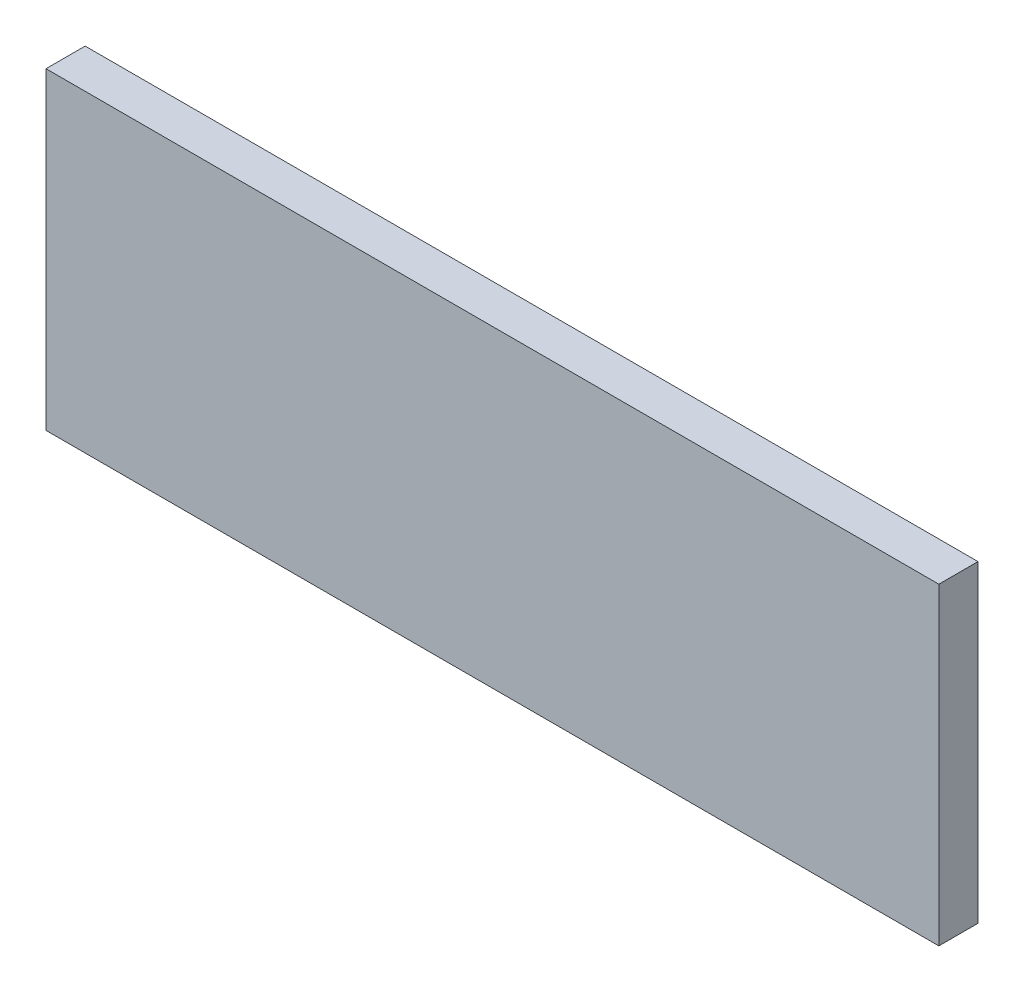
ISO-10303-21;
HEADER;
FILE_DESCRIPTION(('STEP AP214'),'2;1');
FILE_NAME('part.step','',(''),(''),'','','');
FILE_SCHEMA(('AUTOMOTIVE_DESIGN { 1 0 10303 214 1 1 1 1 }'));
ENDSEC;
DATA;
#1=APPLICATION_CONTEXT('core data for automotive mechanical design processes');
#2=APPLICATION_PROTOCOL_DEFINITION('international standard','automotive_design',2000,#1);
#3=PRODUCT_CONTEXT('',#1,'mechanical');
#4=PRODUCT('Part','Part','',(#3));
#5=PRODUCT_RELATED_PRODUCT_CATEGORY('part','',(#4));
#6=PRODUCT_DEFINITION_FORMATION('','',#4);
#7=PRODUCT_DEFINITION_CONTEXT('part definition',#1,'design');
#8=PRODUCT_DEFINITION('design','',#6,#7);
#9=PRODUCT_DEFINITION_SHAPE('','',#8);
#10=(LENGTH_UNIT() NAMED_UNIT(*) SI_UNIT(.MILLI.,.METRE.));
#11=(NAMED_UNIT(*) PLANE_ANGLE_UNIT() SI_UNIT($,.RADIAN.));
#12=(NAMED_UNIT(*) SI_UNIT($,.STERADIAN.) SOLID_ANGLE_UNIT());
#13=UNCERTAINTY_MEASURE_WITH_UNIT(LENGTH_MEASURE(1.E-05),#10,'distance_accuracy_value','');
#14=(GEOMETRIC_REPRESENTATION_CONTEXT(3) GLOBAL_UNCERTAINTY_ASSIGNED_CONTEXT((#13)) GLOBAL_UNIT_ASSIGNED_CONTEXT((#10,
#11,#12)) REPRESENTATION_CONTEXT('',''));
#15=CARTESIAN_POINT('',(0.,0.,0.));
#16=DIRECTION('',(0.,0.,1.));
#17=DIRECTION('',(1.,0.,0.));
#18=AXIS2_PLACEMENT_3D('',#15,#16,#17);
#19=CARTESIAN_POINT('',(-12.2499999999998,-23.,-11.2500000000002));
#20=DIRECTION('',(0.,0.,-1.));
#21=DIRECTION('',(-1.,0.,0.));
#22=AXIS2_PLACEMENT_3D('',#19,#20,#21);
#23=PLANE('',#22);
#24=DIRECTION('',(1.,0.,0.));
#25=VECTOR('',#24,1.);
#26=CARTESIAN_POINT('',(74.9989953281253,-93.7000005401676,-11.2500000000006));
#27=LINE('',#26,#25);
#28=CARTESIAN_POINT('',(-14.2499999999989,-93.7000005401676,-11.2500000000005));
#29=VERTEX_POINT('',#28);
#30=CARTESIAN_POINT('',(14.25,-93.7000005401676,-11.2500000000003));
#31=VERTEX_POINT('',#30);
#32=EDGE_CURVE('E20',#29,#31,#27,.T.);
#33=ORIENTED_EDGE('',*,*,#32,.F.);
#34=DIRECTION('',(0.,1.,0.));
#35=VECTOR('',#34,1.);
#36=CARTESIAN_POINT('',(-14.2499999999989,-33.4535583778433,-11.2500000000006));
#37=LINE('',#36,#35);
#38=CARTESIAN_POINT('',(-14.2499999999989,-83.7000005401676,-11.2500000000004));
#39=VERTEX_POINT('',#38);
#40=EDGE_CURVE('E79',#39,#29,#37,.F.);
#41=ORIENTED_EDGE('',*,*,#40,.F.);
#42=DIRECTION('',(1.,0.,0.));
#43=VECTOR('',#42,1.);
#44=CARTESIAN_POINT('',(74.9989953760509,-83.7000005401676,-11.2500000000003));
#45=LINE('',#44,#43);
#46=CARTESIAN_POINT('',(14.25,-83.7000005401676,-11.2500000000003));
#47=VERTEX_POINT('',#46);
#48=EDGE_CURVE('E61',#47,#39,#45,.F.);
#49=ORIENTED_EDGE('',*,*,#48,.F.);
#50=DIRECTION('',(0.,1.,0.));
#51=VECTOR('',#50,1.);
#52=CARTESIAN_POINT('',(14.25,-33.4535583778433,-11.2500000000003));
#53=LINE('',#52,#51);
#54=EDGE_CURVE('E56',#31,#47,#53,.T.);
#55=ORIENTED_EDGE('',*,*,#54,.F.);
#56=EDGE_LOOP('',(#33,#41,#49,#55));
#57=FACE_BOUND('',#56,.T.);
#58=ADVANCED_FACE('F17',(#57),#23,.T.);
#59=CARTESIAN_POINT('',(74.9989953281253,-93.7000005401676,-19.9999996196601));
#60=DIRECTION('',(0.,-1.,0.));
#61=DIRECTION('',(0.,0.,-1.));
#62=AXIS2_PLACEMENT_3D('',#59,#60,#61);
#63=PLANE('',#62);
#64=DIRECTION('',(1.,0.,-4.79255768693432E-09));
#65=VECTOR('',#64,1.);
#66=CARTESIAN_POINT('',(74.9989953760522,-93.7000005401776,-9.99999961966009));
#67=LINE('',#66,#65);
#68=CARTESIAN_POINT('',(-14.2499999999989,-93.7000005401701,-9.99999926020327));
#69=VERTEX_POINT('',#68);
#70=CARTESIAN_POINT('',(14.25,-93.7000005401701,-9.99999932850684));
#71=VERTEX_POINT('',#70);
#72=EDGE_CURVE('E83',#69,#71,#67,.T.);
#73=ORIENTED_EDGE('',*,*,#72,.F.);
#74=DIRECTION('',(0.,0.,1.));
#75=VECTOR('',#74,1.);
#76=CARTESIAN_POINT('',(-14.2499999999995,-93.7000005401676,11.9999999999998));
#77=LINE('',#76,#75);
#78=EDGE_CURVE('E68',#29,#69,#77,.T.);
#79=ORIENTED_EDGE('',*,*,#78,.F.);
#80=ORIENTED_EDGE('',*,*,#32,.T.);
#81=DIRECTION('',(0.,0.,1.));
#82=VECTOR('',#81,1.);
#83=CARTESIAN_POINT('',(14.25,-93.7000005401676,12.));
#84=LINE('',#83,#82);
#85=EDGE_CURVE('E63',#71,#31,#84,.F.);
#86=ORIENTED_EDGE('',*,*,#85,.F.);
#87=EDGE_LOOP('',(#73,#79,#80,#86));
#88=FACE_BOUND('',#87,.T.);
#89=ADVANCED_FACE('F65',(#88),#63,.T.);
#90=CARTESIAN_POINT('',(14.25,-33.4535583778433,12.));
#91=DIRECTION('',(1.,0.,0.));
#92=DIRECTION('',(0.,1.,0.));
#93=AXIS2_PLACEMENT_3D('',#90,#91,#92);
#94=PLANE('',#93);
#95=DIRECTION('',(0.,1.,0.));
#96=VECTOR('',#95,1.);
#97=CARTESIAN_POINT('',(14.25,-93.7000005401676,-9.99999932851703));
#98=LINE('',#97,#96);
#99=CARTESIAN_POINT('',(14.25,-83.7000005401701,-9.99999929434968));
#100=VERTEX_POINT('',#99);
#101=EDGE_CURVE('E72',#71,#100,#98,.T.);
#102=ORIENTED_EDGE('',*,*,#101,.F.);
#103=ORIENTED_EDGE('',*,*,#85,.T.);
#104=ORIENTED_EDGE('',*,*,#54,.T.);
#105=DIRECTION('',(0.,0.,1.));
#106=VECTOR('',#105,1.);
#107=CARTESIAN_POINT('',(14.25,-83.7000005401676,-9.99999961966009));
#108=LINE('',#107,#106);
#109=EDGE_CURVE('E74',#100,#47,#108,.F.);
#110=ORIENTED_EDGE('',*,*,#109,.F.);
#111=EDGE_LOOP('',(#102,#103,#104,#110));
#112=FACE_BOUND('',#111,.T.);
#113=ADVANCED_FACE('F70',(#112),#94,.T.);
#114=CARTESIAN_POINT('',(74.9989953760509,-83.7000005401676,-9.99999961966009));
#115=DIRECTION('',(0.,1.,0.));
#116=DIRECTION('',(0.,0.,1.));
#117=AXIS2_PLACEMENT_3D('',#114,#115,#116);
#118=PLANE('',#117);
#119=ORIENTED_EDGE('',*,*,#48,.T.);
#120=DIRECTION('',(0.,0.,1.));
#121=VECTOR('',#120,1.);
#122=CARTESIAN_POINT('',(-14.2499999999995,-83.7000005401676,11.9999999999998));
#123=LINE('',#122,#121);
#124=CARTESIAN_POINT('',(-14.2499999999989,-83.7000005401701,-9.99999919190932));
#125=VERTEX_POINT('',#124);
#126=EDGE_CURVE('E35',#125,#39,#123,.F.);
#127=ORIENTED_EDGE('',*,*,#126,.F.);
#128=DIRECTION('',(1.,0.,-4.79255768693432E-09));
#129=VECTOR('',#128,1.);
#130=CARTESIAN_POINT('',(74.9989953760522,-83.7000005401776,-9.99999961966009));
#131=LINE('',#130,#129);
#132=EDGE_CURVE('E26',#100,#125,#131,.F.);
#133=ORIENTED_EDGE('',*,*,#132,.F.);
#134=ORIENTED_EDGE('',*,*,#109,.T.);
#135=EDGE_LOOP('',(#119,#127,#133,#134));
#136=FACE_BOUND('',#135,.T.);
#137=ADVANCED_FACE('F89',(#136),#118,.T.);
#138=CARTESIAN_POINT('',(-14.2499999999995,-33.4535583778433,11.9999999999998));
#139=DIRECTION('',(-1.,0.,0.));
#140=DIRECTION('',(0.,0.,1.));
#141=AXIS2_PLACEMENT_3D('',#138,#139,#140);
#142=PLANE('',#141);
#143=DIRECTION('',(0.,1.,0.));
#144=VECTOR('',#143,1.);
#145=CARTESIAN_POINT('',(-14.2499999999989,-93.7000005401676,-9.99999919192913));
#146=LINE('',#145,#144);
#147=EDGE_CURVE('E11',#125,#69,#146,.F.);
#148=ORIENTED_EDGE('',*,*,#147,.F.);
#149=ORIENTED_EDGE('',*,*,#126,.T.);
#150=ORIENTED_EDGE('',*,*,#40,.T.);
#151=ORIENTED_EDGE('',*,*,#78,.T.);
#152=EDGE_LOOP('',(#148,#149,#150,#151));
#153=FACE_BOUND('',#152,.T.);
#154=ADVANCED_FACE('F91',(#153),#142,.T.);
#155=CARTESIAN_POINT('',(74.9989953760522,-93.7000005401676,-9.99999961966009));
#156=DIRECTION('',(4.79255768693432E-09,0.,1.));
#157=DIRECTION('',(1.,0.,-4.79255768693432E-09));
#158=AXIS2_PLACEMENT_3D('',#155,#156,#157);
#159=PLANE('',#158);
#160=ORIENTED_EDGE('',*,*,#132,.T.);
#161=ORIENTED_EDGE('',*,*,#147,.T.);
#162=ORIENTED_EDGE('',*,*,#72,.T.);
#163=ORIENTED_EDGE('',*,*,#101,.T.);
#164=EDGE_LOOP('',(#160,#161,#162,#163));
#165=FACE_BOUND('',#164,.T.);
#166=ADVANCED_FACE('F88',(#165),#159,.T.);
#167=CLOSED_SHELL('',(#58,#89,#113,#137,#154,#166));
#168=MANIFOLD_SOLID_BREP('B1',#167);
#169=ADVANCED_BREP_SHAPE_REPRESENTATION('',(#18,#168),#14);
#170=SHAPE_DEFINITION_REPRESENTATION(#9,#169);
ENDSEC;
END-ISO-10303-21;
